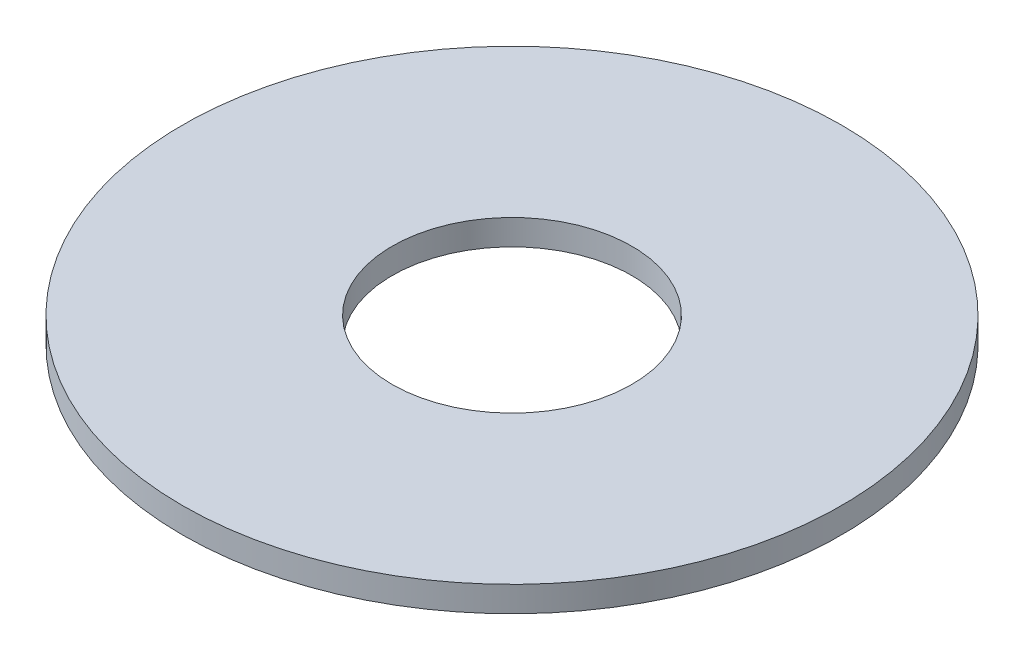
ISO-10303-21;
HEADER;
FILE_DESCRIPTION(('STEP AP214'),'2;1');
FILE_NAME('part.step','',(''),(''),'','','');
FILE_SCHEMA(('AUTOMOTIVE_DESIGN { 1 0 10303 214 1 1 1 1 }'));
ENDSEC;
DATA;
#1=APPLICATION_CONTEXT('core data for automotive mechanical design processes');
#2=APPLICATION_PROTOCOL_DEFINITION('international standard','automotive_design',2000,#1);
#3=PRODUCT_CONTEXT('',#1,'mechanical');
#4=PRODUCT('Part','Part','',(#3));
#5=PRODUCT_RELATED_PRODUCT_CATEGORY('part','',(#4));
#6=PRODUCT_DEFINITION_FORMATION('','',#4);
#7=PRODUCT_DEFINITION_CONTEXT('part definition',#1,'design');
#8=PRODUCT_DEFINITION('design','',#6,#7);
#9=PRODUCT_DEFINITION_SHAPE('','',#8);
#10=(LENGTH_UNIT() NAMED_UNIT(*) SI_UNIT(.MILLI.,.METRE.));
#11=(NAMED_UNIT(*) PLANE_ANGLE_UNIT() SI_UNIT($,.RADIAN.));
#12=(NAMED_UNIT(*) SI_UNIT($,.STERADIAN.) SOLID_ANGLE_UNIT());
#13=UNCERTAINTY_MEASURE_WITH_UNIT(LENGTH_MEASURE(1.E-05),#10,'distance_accuracy_value','');
#14=(GEOMETRIC_REPRESENTATION_CONTEXT(3) GLOBAL_UNCERTAINTY_ASSIGNED_CONTEXT((#13)) GLOBAL_UNIT_ASSIGNED_CONTEXT((#10,
#11,#12)) REPRESENTATION_CONTEXT('',''));
#15=CARTESIAN_POINT('',(0.,0.,0.));
#16=DIRECTION('',(0.,0.,1.));
#17=DIRECTION('',(1.,0.,0.));
#18=AXIS2_PLACEMENT_3D('',#15,#16,#17);
#19=CARTESIAN_POINT('',(0.,0.,0.));
#20=DIRECTION('',(0.,1.,0.));
#21=DIRECTION('',(0.,0.,1.));
#22=AXIS2_PLACEMENT_3D('',#19,#20,#21);
#23=CYLINDRICAL_SURFACE('',#22,4.);
#24=CARTESIAN_POINT('',(0.,0.85,0.));
#25=DIRECTION('',(0.,1.,0.));
#26=DIRECTION('',(0.,0.,1.));
#27=AXIS2_PLACEMENT_3D('',#24,#25,#26);
#28=CIRCLE('',#27,4.);
#29=CARTESIAN_POINT('',(0.,0.85,4.));
#30=VERTEX_POINT('',#29);
#31=EDGE_CURVE('E10',#30,#30,#28,.T.);
#32=ORIENTED_EDGE('',*,*,#31,.T.);
#33=EDGE_LOOP('',(#32));
#34=FACE_BOUND('',#33,.T.);
#35=CARTESIAN_POINT('',(0.,0.,0.));
#36=DIRECTION('',(0.,1.,0.));
#37=DIRECTION('',(0.,0.,1.));
#38=AXIS2_PLACEMENT_3D('',#35,#36,#37);
#39=CIRCLE('',#38,4.);
#40=CARTESIAN_POINT('',(0.,0.,4.));
#41=VERTEX_POINT('',#40);
#42=EDGE_CURVE('E28',#41,#41,#39,.T.);
#43=ORIENTED_EDGE('',*,*,#42,.F.);
#44=EDGE_LOOP('',(#43));
#45=FACE_BOUND('',#44,.T.);
#46=ADVANCED_FACE('F14',(#34,#45),#23,.F.);
#47=CARTESIAN_POINT('',(4.,0.85,0.));
#48=DIRECTION('',(0.,1.,0.));
#49=DIRECTION('',(0.,0.,1.));
#50=AXIS2_PLACEMENT_3D('',#47,#48,#49);
#51=PLANE('',#50);
#52=CARTESIAN_POINT('',(0.,0.85,0.));
#53=DIRECTION('',(0.,1.,0.));
#54=DIRECTION('',(0.,0.,1.));
#55=AXIS2_PLACEMENT_3D('',#52,#53,#54);
#56=CIRCLE('',#55,11.);
#57=CARTESIAN_POINT('',(0.,0.85,11.));
#58=VERTEX_POINT('',#57);
#59=EDGE_CURVE('E20',#58,#58,#56,.T.);
#60=ORIENTED_EDGE('',*,*,#59,.T.);
#61=EDGE_LOOP('',(#60));
#62=FACE_BOUND('',#61,.T.);
#63=ORIENTED_EDGE('',*,*,#31,.F.);
#64=EDGE_LOOP('',(#63));
#65=FACE_BOUND('',#64,.T.);
#66=ADVANCED_FACE('F38',(#62,#65),#51,.T.);
#67=CARTESIAN_POINT('',(0.,0.,0.));
#68=DIRECTION('',(0.,1.,0.));
#69=DIRECTION('',(0.,0.,1.));
#70=AXIS2_PLACEMENT_3D('',#67,#68,#69);
#71=CYLINDRICAL_SURFACE('',#70,11.);
#72=CARTESIAN_POINT('',(0.,0.,0.));
#73=DIRECTION('',(0.,1.,0.));
#74=DIRECTION('',(0.,0.,1.));
#75=AXIS2_PLACEMENT_3D('',#72,#73,#74);
#76=CIRCLE('',#75,11.);
#77=CARTESIAN_POINT('',(0.,0.,11.));
#78=VERTEX_POINT('',#77);
#79=EDGE_CURVE('E24',#78,#78,#76,.T.);
#80=ORIENTED_EDGE('',*,*,#79,.T.);
#81=EDGE_LOOP('',(#80));
#82=FACE_BOUND('',#81,.T.);
#83=ORIENTED_EDGE('',*,*,#59,.F.);
#84=EDGE_LOOP('',(#83));
#85=FACE_BOUND('',#84,.T.);
#86=ADVANCED_FACE('F43',(#82,#85),#71,.T.);
#87=CARTESIAN_POINT('',(11.,0.,0.));
#88=DIRECTION('',(0.,-1.,0.));
#89=DIRECTION('',(0.,0.,-1.));
#90=AXIS2_PLACEMENT_3D('',#87,#88,#89);
#91=PLANE('',#90);
#92=ORIENTED_EDGE('',*,*,#42,.T.);
#93=EDGE_LOOP('',(#92));
#94=FACE_BOUND('',#93,.T.);
#95=ORIENTED_EDGE('',*,*,#79,.F.);
#96=EDGE_LOOP('',(#95));
#97=FACE_BOUND('',#96,.T.);
#98=ADVANCED_FACE('F34',(#94,#97),#91,.T.);
#99=CLOSED_SHELL('',(#46,#66,#86,#98));
#100=MANIFOLD_SOLID_BREP('B1',#99);
#101=ADVANCED_BREP_SHAPE_REPRESENTATION('',(#18,#100),#14);
#102=SHAPE_DEFINITION_REPRESENTATION(#9,#101);
ENDSEC;
END-ISO-10303-21;
